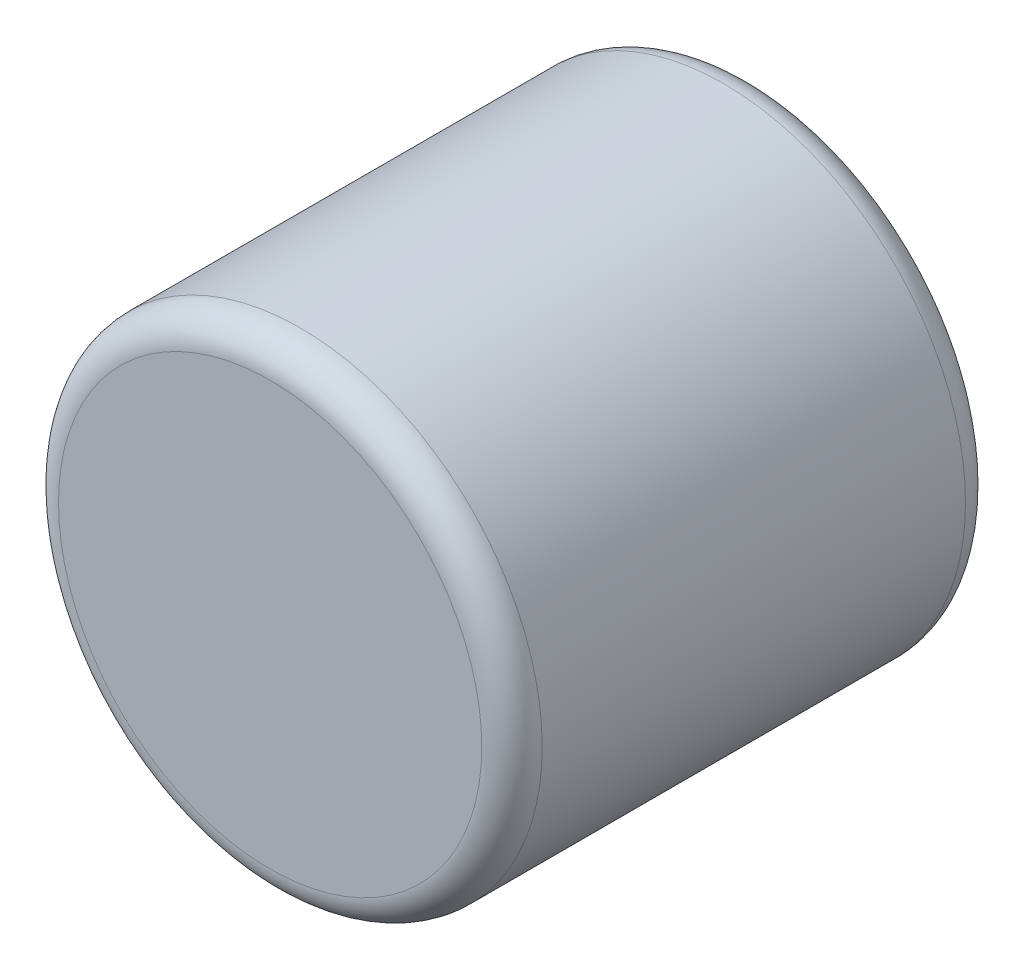
ISO-10303-21;
HEADER;
FILE_DESCRIPTION(('STEP AP214'),'2;1');
FILE_NAME('part.step','',(''),(''),'','','');
FILE_SCHEMA(('AUTOMOTIVE_DESIGN { 1 0 10303 214 1 1 1 1 }'));
ENDSEC;
DATA;
#1=APPLICATION_CONTEXT('core data for automotive mechanical design processes');
#2=APPLICATION_PROTOCOL_DEFINITION('international standard','automotive_design',2000,#1);
#3=PRODUCT_CONTEXT('',#1,'mechanical');
#4=PRODUCT('Part','Part','',(#3));
#5=PRODUCT_RELATED_PRODUCT_CATEGORY('part','',(#4));
#6=PRODUCT_DEFINITION_FORMATION('','',#4);
#7=PRODUCT_DEFINITION_CONTEXT('part definition',#1,'design');
#8=PRODUCT_DEFINITION('design','',#6,#7);
#9=PRODUCT_DEFINITION_SHAPE('','',#8);
#10=(LENGTH_UNIT() NAMED_UNIT(*) SI_UNIT(.MILLI.,.METRE.));
#11=(NAMED_UNIT(*) PLANE_ANGLE_UNIT() SI_UNIT($,.RADIAN.));
#12=(NAMED_UNIT(*) SI_UNIT($,.STERADIAN.) SOLID_ANGLE_UNIT());
#13=UNCERTAINTY_MEASURE_WITH_UNIT(LENGTH_MEASURE(1.E-05),#10,'distance_accuracy_value','');
#14=(GEOMETRIC_REPRESENTATION_CONTEXT(3) GLOBAL_UNCERTAINTY_ASSIGNED_CONTEXT((#13)) GLOBAL_UNIT_ASSIGNED_CONTEXT((#10,
#11,#12)) REPRESENTATION_CONTEXT('',''));
#15=CARTESIAN_POINT('',(0.,0.,0.));
#16=DIRECTION('',(0.,0.,1.));
#17=DIRECTION('',(1.,0.,0.));
#18=AXIS2_PLACEMENT_3D('',#15,#16,#17);
#19=CARTESIAN_POINT('',(0.,0.,-0.8));
#20=DIRECTION('',(0.,0.,1.));
#21=DIRECTION('',(1.,0.,0.));
#22=AXIS2_PLACEMENT_3D('',#19,#20,#21);
#23=PLANE('',#22);
#24=CARTESIAN_POINT('',(0.,0.,-0.8));
#25=DIRECTION('',(0.,0.,1.));
#26=DIRECTION('',(-0.999999801206386,-0.000630545152403891,0.));
#27=AXIS2_PLACEMENT_3D('',#24,#25,#26);
#28=CIRCLE('',#27,0.699999999999993);
#29=CARTESIAN_POINT('',(-0.699999926036326,-0.000219960241665735,-0.8));
#30=VERTEX_POINT('',#29);
#31=CARTESIAN_POINT('',(0.699999930840352,0.000219769453914185,-0.8));
#32=VERTEX_POINT('',#31);
#33=EDGE_CURVE('E46',#30,#32,#28,.T.);
#34=ORIENTED_EDGE('',*,*,#33,.F.);
#35=CARTESIAN_POINT('',(0.,0.,-0.8));
#36=DIRECTION('',(0.,0.,1.));
#37=DIRECTION('',(0.999999802401316,0.00062864722036559,0.));
#38=AXIS2_PLACEMENT_3D('',#35,#36,#37);
#39=CIRCLE('',#38,0.699999999999978);
#40=EDGE_CURVE('E51',#32,#30,#39,.T.);
#41=ORIENTED_EDGE('',*,*,#40,.F.);
#42=EDGE_LOOP('',(#34,#41));
#43=FACE_BOUND('',#42,.T.);
#44=ADVANCED_FACE('F17',(#43),#23,.F.);
#45=CARTESIAN_POINT('',(0.,0.,0.8));
#46=DIRECTION('',(0.,0.,1.));
#47=DIRECTION('',(1.,0.,0.));
#48=AXIS2_PLACEMENT_3D('',#45,#46,#47);
#49=PLANE('',#48);
#50=CARTESIAN_POINT('',(0.,0.,0.8));
#51=DIRECTION('',(0.,0.,-1.));
#52=DIRECTION('',(-1.,0.,0.));
#53=AXIS2_PLACEMENT_3D('',#50,#51,#52);
#54=CIRCLE('',#53,0.7);
#55=CARTESIAN_POINT('',(-0.7,0.,0.8));
#56=VERTEX_POINT('',#55);
#57=CARTESIAN_POINT('',(0.7,0.,0.8));
#58=VERTEX_POINT('',#57);
#59=EDGE_CURVE('E55',#56,#58,#54,.T.);
#60=ORIENTED_EDGE('',*,*,#59,.F.);
#61=CARTESIAN_POINT('',(0.,0.,0.8));
#62=DIRECTION('',(0.,0.,-1.));
#63=DIRECTION('',(1.,0.,0.));
#64=AXIS2_PLACEMENT_3D('',#61,#62,#63);
#65=CIRCLE('',#64,0.7);
#66=EDGE_CURVE('E37',#56,#58,#65,.F.);
#67=ORIENTED_EDGE('',*,*,#66,.T.);
#68=EDGE_LOOP('',(#60,#67));
#69=FACE_BOUND('',#68,.T.);
#70=ADVANCED_FACE('F80',(#69),#49,.T.);
#71=CARTESIAN_POINT('',(0.,0.,-0.7));
#72=DIRECTION('',(0.,0.,1.));
#73=DIRECTION('',(-0.999999801206386,-0.000630545152403891,0.));
#74=AXIS2_PLACEMENT_3D('',#71,#72,#73);
#75=TOROIDAL_SURFACE('',#74,0.7,0.1);
#76=CARTESIAN_POINT('',(0.,0.,-0.7));
#77=DIRECTION('',(0.,0.,1.));
#78=DIRECTION('',(1.,0.,0.));
#79=AXIS2_PLACEMENT_3D('',#76,#77,#78);
#80=CIRCLE('',#79,0.8);
#81=CARTESIAN_POINT('',(0.8,0.,-0.7));
#82=VERTEX_POINT('',#81);
#83=EDGE_CURVE('E29',#82,#82,#80,.T.);
#84=ORIENTED_EDGE('',*,*,#83,.F.);
#85=EDGE_LOOP('',(#84));
#86=FACE_BOUND('',#85,.T.);
#87=ORIENTED_EDGE('',*,*,#33,.T.);
#88=ORIENTED_EDGE('',*,*,#40,.T.);
#89=EDGE_LOOP('',(#87,#88));
#90=FACE_BOUND('',#89,.T.);
#91=ADVANCED_FACE('F50',(#86,#90),#75,.T.);
#92=CARTESIAN_POINT('',(0.,0.,0.7));
#93=DIRECTION('',(0.,0.,1.));
#94=DIRECTION('',(0.999999901488725,-0.000443872210789011,0.));
#95=AXIS2_PLACEMENT_3D('',#92,#93,#94);
#96=TOROIDAL_SURFACE('',#95,0.7,0.1);
#97=CARTESIAN_POINT('',(0.,0.,0.7));
#98=DIRECTION('',(0.,0.,1.));
#99=DIRECTION('',(1.,0.,0.));
#100=AXIS2_PLACEMENT_3D('',#97,#98,#99);
#101=CIRCLE('',#100,0.8);
#102=CARTESIAN_POINT('',(0.8,0.,0.7));
#103=VERTEX_POINT('',#102);
#104=EDGE_CURVE('E11',#103,#103,#101,.F.);
#105=ORIENTED_EDGE('',*,*,#104,.F.);
#106=EDGE_LOOP('',(#105));
#107=FACE_BOUND('',#106,.T.);
#108=ORIENTED_EDGE('',*,*,#66,.F.);
#109=ORIENTED_EDGE('',*,*,#59,.T.);
#110=EDGE_LOOP('',(#108,#109));
#111=FACE_BOUND('',#110,.T.);
#112=ADVANCED_FACE('F79',(#107,#111),#96,.T.);
#113=CARTESIAN_POINT('',(0.,0.,-0.8));
#114=DIRECTION('',(0.,0.,1.));
#115=DIRECTION('',(1.,0.,0.));
#116=AXIS2_PLACEMENT_3D('',#113,#114,#115);
#117=CYLINDRICAL_SURFACE('',#116,0.8);
#118=ORIENTED_EDGE('',*,*,#83,.T.);
#119=EDGE_LOOP('',(#118));
#120=FACE_BOUND('',#119,.T.);
#121=ORIENTED_EDGE('',*,*,#104,.T.);
#122=EDGE_LOOP('',(#121));
#123=FACE_BOUND('',#122,.T.);
#124=ADVANCED_FACE('F121',(#120,#123),#117,.T.);
#125=CLOSED_SHELL('',(#44,#70,#91,#112,#124));
#126=MANIFOLD_SOLID_BREP('B1',#125);
#127=ADVANCED_BREP_SHAPE_REPRESENTATION('',(#18,#126),#14);
#128=SHAPE_DEFINITION_REPRESENTATION(#9,#127);
ENDSEC;
END-ISO-10303-21;
